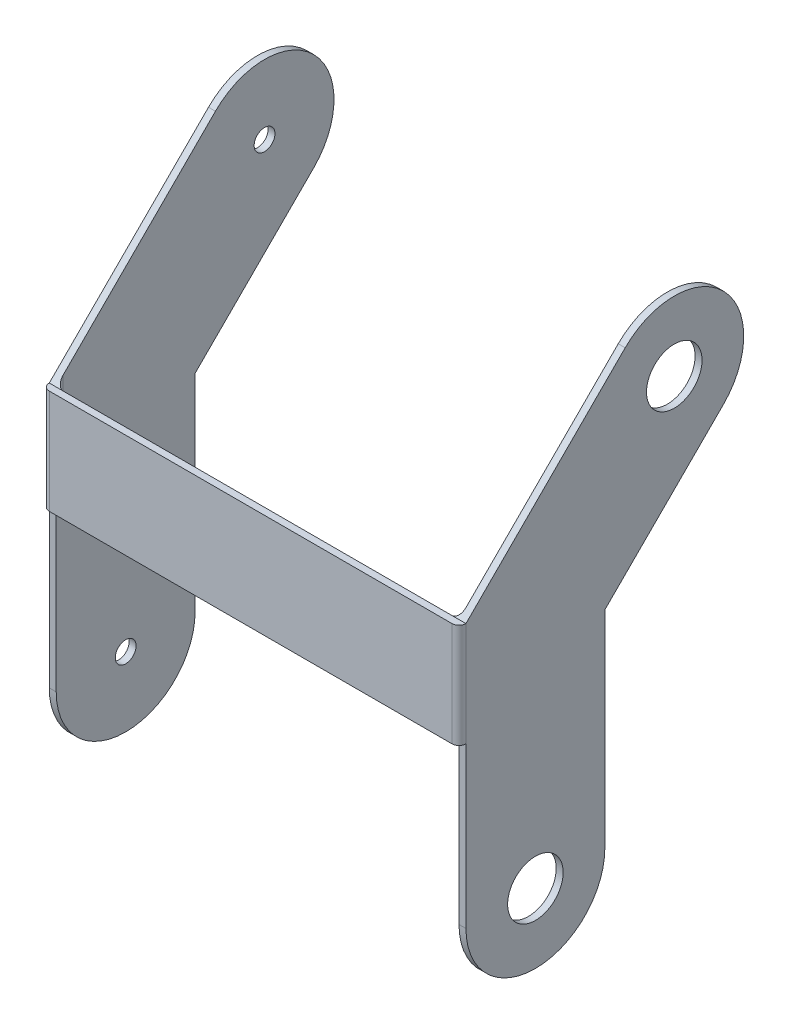
ISO-10303-21;
HEADER;
FILE_DESCRIPTION(('STEP AP214'),'2;1');
FILE_NAME('part.step','',(''),(''),'','','');
FILE_SCHEMA(('AUTOMOTIVE_DESIGN { 1 0 10303 214 1 1 1 1 }'));
ENDSEC;
DATA;
#1=APPLICATION_CONTEXT('core data for automotive mechanical design processes');
#2=APPLICATION_PROTOCOL_DEFINITION('international standard','automotive_design',2000,#1);
#3=PRODUCT_CONTEXT('',#1,'mechanical');
#4=PRODUCT('Part','Part','',(#3));
#5=PRODUCT_RELATED_PRODUCT_CATEGORY('part','',(#4));
#6=PRODUCT_DEFINITION_FORMATION('','',#4);
#7=PRODUCT_DEFINITION_CONTEXT('part definition',#1,'design');
#8=PRODUCT_DEFINITION('design','',#6,#7);
#9=PRODUCT_DEFINITION_SHAPE('','',#8);
#10=(LENGTH_UNIT() NAMED_UNIT(*) SI_UNIT(.MILLI.,.METRE.));
#11=(NAMED_UNIT(*) PLANE_ANGLE_UNIT() SI_UNIT($,.RADIAN.));
#12=(NAMED_UNIT(*) SI_UNIT($,.STERADIAN.) SOLID_ANGLE_UNIT());
#13=UNCERTAINTY_MEASURE_WITH_UNIT(LENGTH_MEASURE(1.E-05),#10,'distance_accuracy_value','');
#14=(GEOMETRIC_REPRESENTATION_CONTEXT(3) GLOBAL_UNCERTAINTY_ASSIGNED_CONTEXT((#13)) GLOBAL_UNIT_ASSIGNED_CONTEXT((#10,
#11,#12)) REPRESENTATION_CONTEXT('',''));
#15=CARTESIAN_POINT('',(0.,0.,0.));
#16=DIRECTION('',(0.,0.,1.));
#17=DIRECTION('',(1.,0.,0.));
#18=AXIS2_PLACEMENT_3D('',#15,#16,#17);
#19=CARTESIAN_POINT('',(1.,-38.019,0.));
#20=DIRECTION('',(0.,0.,-1.));
#21=DIRECTION('',(-1.,0.,0.));
#22=AXIS2_PLACEMENT_3D('',#19,#20,#21);
#23=PLANE('',#22);
#24=DIRECTION('',(-1.,0.,0.));
#25=VECTOR('',#24,1.);
#26=CARTESIAN_POINT('',(30.,-15.,0.));
#27=LINE('',#26,#25);
#28=CARTESIAN_POINT('',(1.,-15.,0.));
#29=VERTEX_POINT('',#28);
#30=CARTESIAN_POINT('',(0.,-15.,0.));
#31=VERTEX_POINT('',#30);
#32=EDGE_CURVE('E164',#29,#31,#27,.T.);
#33=ORIENTED_EDGE('',*,*,#32,.T.);
#34=DIRECTION('',(0.,-1.,0.));
#35=VECTOR('',#34,1.);
#36=CARTESIAN_POINT('',(0.,-38.019,0.));
#37=LINE('',#36,#35);
#38=CARTESIAN_POINT('',(0.,-38.019,0.));
#39=VERTEX_POINT('',#38);
#40=EDGE_CURVE('E175',#31,#39,#37,.T.);
#41=ORIENTED_EDGE('',*,*,#40,.T.);
#42=DIRECTION('',(-1.,0.,0.));
#43=VECTOR('',#42,1.);
#44=CARTESIAN_POINT('',(1.,-38.019,0.));
#45=LINE('',#44,#43);
#46=CARTESIAN_POINT('',(1.,-38.019,0.));
#47=VERTEX_POINT('',#46);
#48=EDGE_CURVE('E236',#47,#39,#45,.T.);
#49=ORIENTED_EDGE('',*,*,#48,.F.);
#50=DIRECTION('',(0.,-1.,0.));
#51=VECTOR('',#50,1.);
#52=CARTESIAN_POINT('',(1.,-38.019,0.));
#53=LINE('',#52,#51);
#54=EDGE_CURVE('E178',#29,#47,#53,.T.);
#55=ORIENTED_EDGE('',*,*,#54,.F.);
#56=EDGE_LOOP('',(#33,#41,#49,#55));
#57=FACE_BOUND('',#56,.T.);
#58=ADVANCED_FACE('F32',(#57),#23,.F.);
#59=CARTESIAN_POINT('',(1.,15.8575766748895,-29.9997122986205));
#60=DIRECTION('',(-1.,0.,0.));
#61=DIRECTION('',(0.,0.,1.));
#62=AXIS2_PLACEMENT_3D('',#59,#60,#61);
#63=PLANE('',#62);
#64=CARTESIAN_POINT('',(1.,15.8575766748895,-29.9997122986205));
#65=DIRECTION('',(1.,0.,0.));
#66=DIRECTION('',(0.,0.,-1.));
#67=AXIS2_PLACEMENT_3D('',#64,#65,#66);
#68=CIRCLE('',#67,1.5);
#69=CARTESIAN_POINT('',(1.,15.8575766748895,-31.4997122986205));
#70=VERTEX_POINT('',#69);
#71=EDGE_CURVE('E190',#70,#70,#68,.T.);
#72=ORIENTED_EDGE('',*,*,#71,.F.);
#73=EDGE_LOOP('',(#72));
#74=FACE_BOUND('',#73,.T.);
#75=DIRECTION('',(0.,-0.707106781186546,0.707106781186549));
#76=VECTOR('',#75,1.);
#77=CARTESIAN_POINT('',(1.,0.,0.));
#78=LINE('',#77,#76);
#79=CARTESIAN_POINT('',(1.,22.928644486755,-22.928644486755));
#80=VERTEX_POINT('',#79);
#81=CARTESIAN_POINT('',(1.,0.999999999999997,-0.999999999999999));
#82=VERTEX_POINT('',#81);
#83=EDGE_CURVE('E242',#80,#82,#78,.T.);
#84=ORIENTED_EDGE('',*,*,#83,.T.);
#85=DIRECTION('',(0.,-1.,0.));
#86=VECTOR('',#85,1.);
#87=CARTESIAN_POINT('',(1.,-15.,-1.));
#88=LINE('',#87,#86);
#89=CARTESIAN_POINT('',(1.,-15.,-1.));
#90=VERTEX_POINT('',#89);
#91=EDGE_CURVE('E233',#82,#90,#88,.T.);
#92=ORIENTED_EDGE('',*,*,#91,.T.);
#93=DIRECTION('',(0.,0.,1.));
#94=VECTOR('',#93,1.);
#95=CARTESIAN_POINT('',(1.,-15.,0.));
#96=LINE('',#95,#94);
#97=EDGE_CURVE('E234',#90,#29,#96,.T.);
#98=ORIENTED_EDGE('',*,*,#97,.T.);
#99=ORIENTED_EDGE('',*,*,#54,.T.);
#100=CARTESIAN_POINT('',(1.,-38.019,-10.));
#101=DIRECTION('',(1.,0.,0.));
#102=DIRECTION('',(0.,0.,1.));
#103=AXIS2_PLACEMENT_3D('',#100,#101,#102);
#104=CIRCLE('',#103,10.);
#105=CARTESIAN_POINT('',(1.,-38.019,-20.));
#106=VERTEX_POINT('',#105);
#107=EDGE_CURVE('E275',#47,#106,#104,.T.);
#108=ORIENTED_EDGE('',*,*,#107,.T.);
#109=DIRECTION('',(0.,1.,0.));
#110=VECTOR('',#109,1.);
#111=CARTESIAN_POINT('',(1.,-8.28427124746194,-20.));
#112=LINE('',#111,#110);
#113=CARTESIAN_POINT('',(1.,-8.28427124746194,-20.));
#114=VERTEX_POINT('',#113);
#115=EDGE_CURVE('E273',#106,#114,#112,.T.);
#116=ORIENTED_EDGE('',*,*,#115,.T.);
#117=DIRECTION('',(0.,0.707106781186546,-0.707106781186549));
#118=VECTOR('',#117,1.);
#119=CARTESIAN_POINT('',(1.,8.78650886302398,-37.070780110486));
#120=LINE('',#119,#118);
#121=CARTESIAN_POINT('',(1.,8.78650886302399,-37.070780110486));
#122=VERTEX_POINT('',#121);
#123=EDGE_CURVE('E271',#114,#122,#120,.T.);
#124=ORIENTED_EDGE('',*,*,#123,.T.);
#125=CARTESIAN_POINT('',(1.,15.8575766748895,-29.9997122986205));
#126=DIRECTION('',(1.,0.,0.));
#127=DIRECTION('',(0.,0.,1.));
#128=AXIS2_PLACEMENT_3D('',#125,#126,#127);
#129=CIRCLE('',#128,10.);
#130=EDGE_CURVE('E269',#122,#80,#129,.T.);
#131=ORIENTED_EDGE('',*,*,#130,.T.);
#132=EDGE_LOOP('',(#84,#92,#98,#99,#108,#116,#124,#131));
#133=FACE_BOUND('',#132,.T.);
#134=CARTESIAN_POINT('',(1.,-38.019,-10.));
#135=DIRECTION('',(1.,0.,0.));
#136=DIRECTION('',(0.,0.,-1.));
#137=AXIS2_PLACEMENT_3D('',#134,#135,#136);
#138=CIRCLE('',#137,1.5);
#139=CARTESIAN_POINT('',(1.,-38.019,-11.5));
#140=VERTEX_POINT('',#139);
#141=EDGE_CURVE('E281',#140,#140,#138,.T.);
#142=ORIENTED_EDGE('',*,*,#141,.F.);
#143=EDGE_LOOP('',(#142));
#144=FACE_BOUND('',#143,.T.);
#145=ADVANCED_FACE('F239',(#74,#133,#144),#63,.F.);
#146=CARTESIAN_POINT('',(0.,15.8575766748895,-29.9997122986205));
#147=DIRECTION('',(-1.,0.,0.));
#148=DIRECTION('',(0.,0.,1.));
#149=AXIS2_PLACEMENT_3D('',#146,#147,#148);
#150=PLANE('',#149);
#151=CARTESIAN_POINT('',(0.,15.8575766748895,-29.9997122986205));
#152=DIRECTION('',(1.,0.,0.));
#153=DIRECTION('',(0.,0.,-1.));
#154=AXIS2_PLACEMENT_3D('',#151,#152,#153);
#155=CIRCLE('',#154,1.5);
#156=CARTESIAN_POINT('',(0.,15.8575766748895,-31.4997122986205));
#157=VERTEX_POINT('',#156);
#158=EDGE_CURVE('E278',#157,#157,#155,.T.);
#159=ORIENTED_EDGE('',*,*,#158,.T.);
#160=EDGE_LOOP('',(#159));
#161=FACE_BOUND('',#160,.T.);
#162=ORIENTED_EDGE('',*,*,#40,.F.);
#163=DIRECTION('',(0.,-1.,0.));
#164=VECTOR('',#163,1.);
#165=CARTESIAN_POINT('',(0.,0.,0.));
#166=LINE('',#165,#164);
#167=CARTESIAN_POINT('',(0.,0.,0.));
#168=VERTEX_POINT('',#167);
#169=EDGE_CURVE('E122',#31,#168,#166,.F.);
#170=ORIENTED_EDGE('',*,*,#169,.T.);
#171=DIRECTION('',(0.,-0.707106781186546,0.707106781186549));
#172=VECTOR('',#171,1.);
#173=CARTESIAN_POINT('',(0.,0.,0.));
#174=LINE('',#173,#172);
#175=CARTESIAN_POINT('',(0.,22.928644486755,-22.928644486755));
#176=VERTEX_POINT('',#175);
#177=EDGE_CURVE('E259',#176,#168,#174,.T.);
#178=ORIENTED_EDGE('',*,*,#177,.F.);
#179=CARTESIAN_POINT('',(0.,15.8575766748895,-29.9997122986205));
#180=DIRECTION('',(1.,0.,0.));
#181=DIRECTION('',(0.,0.,1.));
#182=AXIS2_PLACEMENT_3D('',#179,#180,#181);
#183=CIRCLE('',#182,10.);
#184=CARTESIAN_POINT('',(0.,8.78650886302399,-37.070780110486));
#185=VERTEX_POINT('',#184);
#186=EDGE_CURVE('E261',#185,#176,#183,.T.);
#187=ORIENTED_EDGE('',*,*,#186,.F.);
#188=DIRECTION('',(0.,0.707106781186546,-0.707106781186549));
#189=VECTOR('',#188,1.);
#190=CARTESIAN_POINT('',(0.,8.78650886302398,-37.070780110486));
#191=LINE('',#190,#189);
#192=CARTESIAN_POINT('',(0.,-8.28427124746194,-20.));
#193=VERTEX_POINT('',#192);
#194=EDGE_CURVE('E263',#193,#185,#191,.T.);
#195=ORIENTED_EDGE('',*,*,#194,.F.);
#196=DIRECTION('',(0.,1.,0.));
#197=VECTOR('',#196,1.);
#198=CARTESIAN_POINT('',(0.,-8.28427124746194,-20.));
#199=LINE('',#198,#197);
#200=CARTESIAN_POINT('',(0.,-38.019,-20.));
#201=VERTEX_POINT('',#200);
#202=EDGE_CURVE('E265',#201,#193,#199,.T.);
#203=ORIENTED_EDGE('',*,*,#202,.F.);
#204=CARTESIAN_POINT('',(0.,-38.019,-10.));
#205=DIRECTION('',(1.,0.,0.));
#206=DIRECTION('',(0.,0.,1.));
#207=AXIS2_PLACEMENT_3D('',#204,#205,#206);
#208=CIRCLE('',#207,10.);
#209=EDGE_CURVE('E188',#39,#201,#208,.T.);
#210=ORIENTED_EDGE('',*,*,#209,.F.);
#211=EDGE_LOOP('',(#162,#170,#178,#187,#195,#203,#210));
#212=FACE_BOUND('',#211,.T.);
#213=CARTESIAN_POINT('',(0.,-38.019,-10.));
#214=DIRECTION('',(1.,0.,0.));
#215=DIRECTION('',(0.,0.,-1.));
#216=AXIS2_PLACEMENT_3D('',#213,#214,#215);
#217=CIRCLE('',#216,1.5);
#218=CARTESIAN_POINT('',(0.,-38.019,-11.5));
#219=VERTEX_POINT('',#218);
#220=EDGE_CURVE('E284',#219,#219,#217,.T.);
#221=ORIENTED_EDGE('',*,*,#220,.T.);
#222=EDGE_LOOP('',(#221));
#223=FACE_BOUND('',#222,.T.);
#224=ADVANCED_FACE('F182',(#161,#212,#223),#150,.T.);
#225=CARTESIAN_POINT('',(1.,-38.019,-10.));
#226=DIRECTION('',(-1.,0.,0.));
#227=DIRECTION('',(0.,0.,1.));
#228=AXIS2_PLACEMENT_3D('',#225,#226,#227);
#229=CYLINDRICAL_SURFACE('',#228,10.);
#230=ORIENTED_EDGE('',*,*,#209,.T.);
#231=DIRECTION('',(-1.,0.,0.));
#232=VECTOR('',#231,1.);
#233=CARTESIAN_POINT('',(1.,-38.019,-20.));
#234=LINE('',#233,#232);
#235=EDGE_CURVE('E246',#106,#201,#234,.T.);
#236=ORIENTED_EDGE('',*,*,#235,.F.);
#237=ORIENTED_EDGE('',*,*,#107,.F.);
#238=ORIENTED_EDGE('',*,*,#48,.T.);
#239=EDGE_LOOP('',(#230,#236,#237,#238));
#240=FACE_BOUND('',#239,.T.);
#241=ADVANCED_FACE('F426',(#240),#229,.T.);
#242=CARTESIAN_POINT('',(1.,-8.28427124746194,-20.));
#243=DIRECTION('',(0.,0.,1.));
#244=DIRECTION('',(1.,0.,0.));
#245=AXIS2_PLACEMENT_3D('',#242,#243,#244);
#246=PLANE('',#245);
#247=ORIENTED_EDGE('',*,*,#202,.T.);
#248=DIRECTION('',(-1.,0.,0.));
#249=VECTOR('',#248,1.);
#250=CARTESIAN_POINT('',(1.,-8.28427124746194,-20.));
#251=LINE('',#250,#249);
#252=EDGE_CURVE('E249',#114,#193,#251,.T.);
#253=ORIENTED_EDGE('',*,*,#252,.F.);
#254=ORIENTED_EDGE('',*,*,#115,.F.);
#255=ORIENTED_EDGE('',*,*,#235,.T.);
#256=EDGE_LOOP('',(#247,#253,#254,#255));
#257=FACE_BOUND('',#256,.T.);
#258=ADVANCED_FACE('F623',(#257),#246,.F.);
#259=CARTESIAN_POINT('',(1.,8.78650886302398,-37.070780110486));
#260=DIRECTION('',(0.,0.707106781186549,0.707106781186546));
#261=DIRECTION('',(0.,-0.707106781186546,0.707106781186549));
#262=AXIS2_PLACEMENT_3D('',#259,#260,#261);
#263=PLANE('',#262);
#264=ORIENTED_EDGE('',*,*,#194,.T.);
#265=DIRECTION('',(-1.,0.,0.));
#266=VECTOR('',#265,1.);
#267=CARTESIAN_POINT('',(1.,8.78650886302399,-37.070780110486));
#268=LINE('',#267,#266);
#269=EDGE_CURVE('E252',#122,#185,#268,.T.);
#270=ORIENTED_EDGE('',*,*,#269,.F.);
#271=ORIENTED_EDGE('',*,*,#123,.F.);
#272=ORIENTED_EDGE('',*,*,#252,.T.);
#273=EDGE_LOOP('',(#264,#270,#271,#272));
#274=FACE_BOUND('',#273,.T.);
#275=ADVANCED_FACE('F614',(#274),#263,.F.);
#276=CARTESIAN_POINT('',(1.,15.8575766748895,-29.9997122986205));
#277=DIRECTION('',(-1.,0.,0.));
#278=DIRECTION('',(0.,0.,1.));
#279=AXIS2_PLACEMENT_3D('',#276,#277,#278);
#280=CYLINDRICAL_SURFACE('',#279,10.);
#281=ORIENTED_EDGE('',*,*,#186,.T.);
#282=DIRECTION('',(-1.,0.,0.));
#283=VECTOR('',#282,1.);
#284=CARTESIAN_POINT('',(1.,22.928644486755,-22.928644486755));
#285=LINE('',#284,#283);
#286=EDGE_CURVE('E255',#80,#176,#285,.T.);
#287=ORIENTED_EDGE('',*,*,#286,.F.);
#288=ORIENTED_EDGE('',*,*,#130,.F.);
#289=ORIENTED_EDGE('',*,*,#269,.T.);
#290=EDGE_LOOP('',(#281,#287,#288,#289));
#291=FACE_BOUND('',#290,.T.);
#292=ADVANCED_FACE('F607',(#291),#280,.T.);
#293=CARTESIAN_POINT('',(1.,0.,0.));
#294=DIRECTION('',(0.,-0.707106781186549,-0.707106781186546));
#295=DIRECTION('',(0.,0.707106781186546,-0.707106781186549));
#296=AXIS2_PLACEMENT_3D('',#293,#294,#295);
#297=PLANE('',#296);
#298=ORIENTED_EDGE('',*,*,#177,.T.);
#299=DIRECTION('',(-1.,0.,0.));
#300=VECTOR('',#299,1.);
#301=CARTESIAN_POINT('',(1.,0.,0.));
#302=LINE('',#301,#300);
#303=CARTESIAN_POINT('',(2.,0.,0.));
#304=VERTEX_POINT('',#303);
#305=EDGE_CURVE('E70',#304,#168,#302,.T.);
#306=ORIENTED_EDGE('',*,*,#305,.F.);
#307=CARTESIAN_POINT('',(2.,0.999999999999997,-0.999999999999999));
#308=DIRECTION('',(0.,-0.707106781186549,-0.707106781186546));
#309=DIRECTION('',(0.,0.707106781186546,-0.707106781186549));
#310=AXIS2_PLACEMENT_3D('',#307,#308,#309);
#311=ELLIPSE('',#310,1.41421356237309,1.);
#312=EDGE_CURVE('E132',#304,#82,#311,.T.);
#313=ORIENTED_EDGE('',*,*,#312,.T.);
#314=ORIENTED_EDGE('',*,*,#83,.F.);
#315=ORIENTED_EDGE('',*,*,#286,.T.);
#316=EDGE_LOOP('',(#298,#306,#313,#314,#315));
#317=FACE_BOUND('',#316,.T.);
#318=ADVANCED_FACE('F598',(#317),#297,.F.);
#319=CARTESIAN_POINT('',(1.,15.8575766748895,-29.9997122986205));
#320=DIRECTION('',(-1.,0.,0.));
#321=DIRECTION('',(0.,0.,1.));
#322=AXIS2_PLACEMENT_3D('',#319,#320,#321);
#323=CYLINDRICAL_SURFACE('',#322,1.5);
#324=ORIENTED_EDGE('',*,*,#71,.T.);
#325=EDGE_LOOP('',(#324));
#326=FACE_BOUND('',#325,.T.);
#327=ORIENTED_EDGE('',*,*,#158,.F.);
#328=EDGE_LOOP('',(#327));
#329=FACE_BOUND('',#328,.T.);
#330=ADVANCED_FACE('F589',(#326,#329),#323,.F.);
#331=CARTESIAN_POINT('',(1.,-38.019,-10.));
#332=DIRECTION('',(-1.,0.,0.));
#333=DIRECTION('',(0.,0.,1.));
#334=AXIS2_PLACEMENT_3D('',#331,#332,#333);
#335=CYLINDRICAL_SURFACE('',#334,1.5);
#336=ORIENTED_EDGE('',*,*,#141,.T.);
#337=EDGE_LOOP('',(#336));
#338=FACE_BOUND('',#337,.T.);
#339=ORIENTED_EDGE('',*,*,#220,.F.);
#340=EDGE_LOOP('',(#339));
#341=FACE_BOUND('',#340,.T.);
#342=ADVANCED_FACE('F562',(#338,#341),#335,.F.);
#343=CARTESIAN_POINT('',(30.,0.,0.));
#344=DIRECTION('',(0.,0.,1.));
#345=DIRECTION('',(0.,-1.,0.));
#346=AXIS2_PLACEMENT_3D('',#343,#344,#345);
#347=PLANE('',#346);
#348=CARTESIAN_POINT('',(58.,-15.,0.));
#349=VERTEX_POINT('',#348);
#350=CARTESIAN_POINT('',(2.,-15.,0.));
#351=VERTEX_POINT('',#350);
#352=EDGE_CURVE('E134',#349,#351,#27,.T.);
#353=ORIENTED_EDGE('',*,*,#352,.T.);
#354=DIRECTION('',(0.,-1.,0.));
#355=VECTOR('',#354,1.);
#356=CARTESIAN_POINT('',(2.,0.,0.));
#357=LINE('',#356,#355);
#358=EDGE_CURVE('E151',#351,#304,#357,.F.);
#359=ORIENTED_EDGE('',*,*,#358,.T.);
#360=DIRECTION('',(-1.,0.,0.));
#361=VECTOR('',#360,1.);
#362=CARTESIAN_POINT('',(30.,0.,0.));
#363=LINE('',#362,#361);
#364=CARTESIAN_POINT('',(58.,0.,0.));
#365=VERTEX_POINT('',#364);
#366=EDGE_CURVE('E117',#365,#304,#363,.T.);
#367=ORIENTED_EDGE('',*,*,#366,.F.);
#368=DIRECTION('',(0.,-1.,0.));
#369=VECTOR('',#368,1.);
#370=CARTESIAN_POINT('',(58.,-15.,0.));
#371=LINE('',#370,#369);
#372=EDGE_CURVE('E153',#365,#349,#371,.T.);
#373=ORIENTED_EDGE('',*,*,#372,.T.);
#374=EDGE_LOOP('',(#353,#359,#367,#373));
#375=FACE_BOUND('',#374,.T.);
#376=ADVANCED_FACE('F554',(#375),#347,.F.);
#377=CARTESIAN_POINT('',(30.,0.,0.));
#378=DIRECTION('',(0.,-1.,0.));
#379=DIRECTION('',(0.,0.,-1.));
#380=AXIS2_PLACEMENT_3D('',#377,#378,#379);
#381=PLANE('',#380);
#382=ORIENTED_EDGE('',*,*,#305,.T.);
#383=CARTESIAN_POINT('',(1.,0.,0.));
#384=DIRECTION('',(0.,-1.,0.));
#385=DIRECTION('',(0.,0.,-1.));
#386=AXIS2_PLACEMENT_3D('',#383,#384,#385);
#387=CIRCLE('',#386,1.);
#388=CARTESIAN_POINT('',(1.,0.,1.));
#389=VERTEX_POINT('',#388);
#390=EDGE_CURVE('E116',#168,#389,#387,.F.);
#391=ORIENTED_EDGE('',*,*,#390,.T.);
#392=DIRECTION('',(-1.,0.,0.));
#393=VECTOR('',#392,1.);
#394=CARTESIAN_POINT('',(30.,0.,1.));
#395=LINE('',#394,#393);
#396=CARTESIAN_POINT('',(59.,0.,1.));
#397=VERTEX_POINT('',#396);
#398=EDGE_CURVE('E103',#397,#389,#395,.T.);
#399=ORIENTED_EDGE('',*,*,#398,.F.);
#400=CARTESIAN_POINT('',(59.,0.,0.));
#401=DIRECTION('',(0.,-1.,0.));
#402=DIRECTION('',(0.,0.,-1.));
#403=AXIS2_PLACEMENT_3D('',#400,#401,#402);
#404=CIRCLE('',#403,1.);
#405=CARTESIAN_POINT('',(60.,0.,0.));
#406=VERTEX_POINT('',#405);
#407=EDGE_CURVE('E114',#397,#406,#404,.F.);
#408=ORIENTED_EDGE('',*,*,#407,.T.);
#409=DIRECTION('',(1.,0.,0.));
#410=VECTOR('',#409,1.);
#411=CARTESIAN_POINT('',(59.,0.,0.));
#412=LINE('',#411,#410);
#413=EDGE_CURVE('E47',#365,#406,#412,.T.);
#414=ORIENTED_EDGE('',*,*,#413,.F.);
#415=ORIENTED_EDGE('',*,*,#366,.T.);
#416=EDGE_LOOP('',(#382,#391,#399,#408,#414,#415));
#417=FACE_BOUND('',#416,.T.);
#418=ADVANCED_FACE('F112',(#417),#381,.F.);
#419=CARTESIAN_POINT('',(30.,0.,1.));
#420=DIRECTION('',(0.,0.,-1.));
#421=DIRECTION('',(0.,1.,0.));
#422=AXIS2_PLACEMENT_3D('',#419,#420,#421);
#423=PLANE('',#422);
#424=ORIENTED_EDGE('',*,*,#398,.T.);
#425=DIRECTION('',(0.,-1.,0.));
#426=VECTOR('',#425,1.);
#427=CARTESIAN_POINT('',(1.,-15.,0.999999999999998));
#428=LINE('',#427,#426);
#429=CARTESIAN_POINT('',(1.,-15.,0.999999999999998));
#430=VERTEX_POINT('',#429);
#431=EDGE_CURVE('E110',#389,#430,#428,.T.);
#432=ORIENTED_EDGE('',*,*,#431,.T.);
#433=DIRECTION('',(-1.,0.,0.));
#434=VECTOR('',#433,1.);
#435=CARTESIAN_POINT('',(30.,-15.,0.999999999999998));
#436=LINE('',#435,#434);
#437=CARTESIAN_POINT('',(59.,-15.,0.999999999999998));
#438=VERTEX_POINT('',#437);
#439=EDGE_CURVE('E106',#438,#430,#436,.T.);
#440=ORIENTED_EDGE('',*,*,#439,.F.);
#441=DIRECTION('',(0.,-1.,0.));
#442=VECTOR('',#441,1.);
#443=CARTESIAN_POINT('',(59.,0.,1.));
#444=LINE('',#443,#442);
#445=EDGE_CURVE('E99',#438,#397,#444,.F.);
#446=ORIENTED_EDGE('',*,*,#445,.T.);
#447=EDGE_LOOP('',(#424,#432,#440,#446));
#448=FACE_BOUND('',#447,.T.);
#449=ADVANCED_FACE('F101',(#448),#423,.F.);
#450=CARTESIAN_POINT('',(30.,-15.,0.));
#451=DIRECTION('',(0.,1.,0.));
#452=DIRECTION('',(0.,0.,1.));
#453=AXIS2_PLACEMENT_3D('',#450,#451,#452);
#454=PLANE('',#453);
#455=ORIENTED_EDGE('',*,*,#439,.T.);
#456=CARTESIAN_POINT('',(1.,-15.,0.));
#457=DIRECTION('',(0.,1.,0.));
#458=DIRECTION('',(0.,0.,1.));
#459=AXIS2_PLACEMENT_3D('',#456,#457,#458);
#460=CIRCLE('',#459,1.);
#461=EDGE_CURVE('E126',#430,#31,#460,.F.);
#462=ORIENTED_EDGE('',*,*,#461,.T.);
#463=ORIENTED_EDGE('',*,*,#32,.F.);
#464=ORIENTED_EDGE('',*,*,#97,.F.);
#465=CARTESIAN_POINT('',(2.,-15.,-1.));
#466=DIRECTION('',(0.,1.,0.));
#467=DIRECTION('',(0.,0.,1.));
#468=AXIS2_PLACEMENT_3D('',#465,#466,#467);
#469=CIRCLE('',#468,1.);
#470=EDGE_CURVE('E81',#90,#351,#469,.T.);
#471=ORIENTED_EDGE('',*,*,#470,.T.);
#472=ORIENTED_EDGE('',*,*,#352,.F.);
#473=CARTESIAN_POINT('',(58.,-15.,-1.));
#474=DIRECTION('',(0.,1.,0.));
#475=DIRECTION('',(0.,0.,1.));
#476=AXIS2_PLACEMENT_3D('',#473,#474,#475);
#477=CIRCLE('',#476,1.);
#478=CARTESIAN_POINT('',(59.,-15.,-1.));
#479=VERTEX_POINT('',#478);
#480=EDGE_CURVE('E40',#349,#479,#477,.T.);
#481=ORIENTED_EDGE('',*,*,#480,.T.);
#482=DIRECTION('',(0.,0.,-1.));
#483=VECTOR('',#482,1.);
#484=CARTESIAN_POINT('',(59.,-15.,0.));
#485=LINE('',#484,#483);
#486=CARTESIAN_POINT('',(59.,-15.,0.));
#487=VERTEX_POINT('',#486);
#488=EDGE_CURVE('E56',#487,#479,#485,.T.);
#489=ORIENTED_EDGE('',*,*,#488,.F.);
#490=DIRECTION('',(1.,0.,0.));
#491=VECTOR('',#490,1.);
#492=CARTESIAN_POINT('',(30.,-15.,0.));
#493=LINE('',#492,#491);
#494=CARTESIAN_POINT('',(60.,-15.,0.));
#495=VERTEX_POINT('',#494);
#496=EDGE_CURVE('E325',#487,#495,#493,.T.);
#497=ORIENTED_EDGE('',*,*,#496,.T.);
#498=CARTESIAN_POINT('',(59.,-15.,0.));
#499=DIRECTION('',(0.,1.,0.));
#500=DIRECTION('',(0.,0.,1.));
#501=AXIS2_PLACEMENT_3D('',#498,#499,#500);
#502=CIRCLE('',#501,1.);
#503=EDGE_CURVE('E158',#495,#438,#502,.F.);
#504=ORIENTED_EDGE('',*,*,#503,.T.);
#505=EDGE_LOOP('',(#455,#462,#463,#464,#471,#472,#481,#489,#497,#504));
#506=FACE_BOUND('',#505,.T.);
#507=ADVANCED_FACE('F133',(#506),#454,.F.);
#508=CARTESIAN_POINT('',(59.,-38.019,0.));
#509=DIRECTION('',(0.,0.,-1.));
#510=DIRECTION('',(1.,0.,0.));
#511=AXIS2_PLACEMENT_3D('',#508,#509,#510);
#512=PLANE('',#511);
#513=ORIENTED_EDGE('',*,*,#496,.F.);
#514=DIRECTION('',(0.,-1.,0.));
#515=VECTOR('',#514,1.);
#516=CARTESIAN_POINT('',(59.,-38.019,0.));
#517=LINE('',#516,#515);
#518=CARTESIAN_POINT('',(59.,-38.019,0.));
#519=VERTEX_POINT('',#518);
#520=EDGE_CURVE('E146',#487,#519,#517,.T.);
#521=ORIENTED_EDGE('',*,*,#520,.T.);
#522=DIRECTION('',(1.,0.,0.));
#523=VECTOR('',#522,1.);
#524=CARTESIAN_POINT('',(59.,-38.019,0.));
#525=LINE('',#524,#523);
#526=CARTESIAN_POINT('',(60.,-38.019,0.));
#527=VERTEX_POINT('',#526);
#528=EDGE_CURVE('E179',#519,#527,#525,.T.);
#529=ORIENTED_EDGE('',*,*,#528,.T.);
#530=DIRECTION('',(0.,-1.,0.));
#531=VECTOR('',#530,1.);
#532=CARTESIAN_POINT('',(60.,-38.019,0.));
#533=LINE('',#532,#531);
#534=EDGE_CURVE('E322',#495,#527,#533,.T.);
#535=ORIENTED_EDGE('',*,*,#534,.F.);
#536=EDGE_LOOP('',(#513,#521,#529,#535));
#537=FACE_BOUND('',#536,.T.);
#538=ADVANCED_FACE('F406',(#537),#512,.F.);
#539=CARTESIAN_POINT('',(59.,15.8575766748895,-29.9997122986205));
#540=DIRECTION('',(1.,0.,0.));
#541=DIRECTION('',(0.,0.,1.));
#542=AXIS2_PLACEMENT_3D('',#539,#540,#541);
#543=PLANE('',#542);
#544=CARTESIAN_POINT('',(59.,-38.019,-10.));
#545=DIRECTION('',(1.,0.,0.));
#546=DIRECTION('',(0.,0.,-1.));
#547=AXIS2_PLACEMENT_3D('',#544,#545,#546);
#548=CIRCLE('',#547,4.);
#549=CARTESIAN_POINT('',(59.,-38.019,-14.));
#550=VERTEX_POINT('',#549);
#551=EDGE_CURVE('E347',#550,#550,#548,.F.);
#552=ORIENTED_EDGE('',*,*,#551,.F.);
#553=EDGE_LOOP('',(#552));
#554=FACE_BOUND('',#553,.T.);
#555=CARTESIAN_POINT('',(59.,15.8575766748895,-29.9997122986205));
#556=DIRECTION('',(1.,0.,0.));
#557=DIRECTION('',(0.,0.,-1.));
#558=AXIS2_PLACEMENT_3D('',#555,#556,#557);
#559=CIRCLE('',#558,4.00000000000001);
#560=CARTESIAN_POINT('',(59.,15.8575766748895,-33.9997122986205));
#561=VERTEX_POINT('',#560);
#562=EDGE_CURVE('E341',#561,#561,#559,.F.);
#563=ORIENTED_EDGE('',*,*,#562,.F.);
#564=EDGE_LOOP('',(#563));
#565=FACE_BOUND('',#564,.T.);
#566=ORIENTED_EDGE('',*,*,#520,.F.);
#567=ORIENTED_EDGE('',*,*,#488,.T.);
#568=DIRECTION('',(0.,-1.,0.));
#569=VECTOR('',#568,1.);
#570=CARTESIAN_POINT('',(59.,0.,-1.));
#571=LINE('',#570,#569);
#572=CARTESIAN_POINT('',(59.,0.999999999999997,-1.));
#573=VERTEX_POINT('',#572);
#574=EDGE_CURVE('E142',#479,#573,#571,.F.);
#575=ORIENTED_EDGE('',*,*,#574,.T.);
#576=DIRECTION('',(0.,-0.707106781186546,0.707106781186549));
#577=VECTOR('',#576,1.);
#578=CARTESIAN_POINT('',(59.,0.,0.));
#579=LINE('',#578,#577);
#580=CARTESIAN_POINT('',(59.,22.928644486755,-22.928644486755));
#581=VERTEX_POINT('',#580);
#582=EDGE_CURVE('E306',#581,#573,#579,.T.);
#583=ORIENTED_EDGE('',*,*,#582,.F.);
#584=CARTESIAN_POINT('',(59.,15.8575766748895,-29.9997122986205));
#585=DIRECTION('',(1.,0.,0.));
#586=DIRECTION('',(0.,0.,1.));
#587=AXIS2_PLACEMENT_3D('',#584,#585,#586);
#588=CIRCLE('',#587,10.);
#589=CARTESIAN_POINT('',(59.,8.78650886302399,-37.070780110486));
#590=VERTEX_POINT('',#589);
#591=EDGE_CURVE('E327',#590,#581,#588,.T.);
#592=ORIENTED_EDGE('',*,*,#591,.F.);
#593=DIRECTION('',(0.,0.707106781186546,-0.707106781186549));
#594=VECTOR('',#593,1.);
#595=CARTESIAN_POINT('',(59.,8.78650886302398,-37.070780110486));
#596=LINE('',#595,#594);
#597=CARTESIAN_POINT('',(59.,-8.28427124746194,-20.));
#598=VERTEX_POINT('',#597);
#599=EDGE_CURVE('E330',#598,#590,#596,.T.);
#600=ORIENTED_EDGE('',*,*,#599,.F.);
#601=DIRECTION('',(0.,1.,0.));
#602=VECTOR('',#601,1.);
#603=CARTESIAN_POINT('',(59.,-8.28427124746194,-20.));
#604=LINE('',#603,#602);
#605=CARTESIAN_POINT('',(59.,-38.019,-20.));
#606=VERTEX_POINT('',#605);
#607=EDGE_CURVE('E333',#606,#598,#604,.T.);
#608=ORIENTED_EDGE('',*,*,#607,.F.);
#609=CARTESIAN_POINT('',(59.,-38.019,-10.));
#610=DIRECTION('',(1.,0.,0.));
#611=DIRECTION('',(0.,0.,1.));
#612=AXIS2_PLACEMENT_3D('',#609,#610,#611);
#613=CIRCLE('',#612,10.);
#614=EDGE_CURVE('E336',#519,#606,#613,.T.);
#615=ORIENTED_EDGE('',*,*,#614,.F.);
#616=EDGE_LOOP('',(#566,#567,#575,#583,#592,#600,#608,#615));
#617=FACE_BOUND('',#616,.T.);
#618=ADVANCED_FACE('F140',(#554,#565,#617),#543,.F.);
#619=CARTESIAN_POINT('',(60.,15.8575766748895,-29.9997122986205));
#620=DIRECTION('',(1.,0.,0.));
#621=DIRECTION('',(0.,0.,1.));
#622=AXIS2_PLACEMENT_3D('',#619,#620,#621);
#623=PLANE('',#622);
#624=CARTESIAN_POINT('',(60.,-38.019,-10.));
#625=DIRECTION('',(1.,0.,0.));
#626=DIRECTION('',(0.,0.,-1.));
#627=AXIS2_PLACEMENT_3D('',#624,#625,#626);
#628=CIRCLE('',#627,4.);
#629=CARTESIAN_POINT('',(60.,-38.019,-14.));
#630=VERTEX_POINT('',#629);
#631=EDGE_CURVE('E350',#630,#630,#628,.T.);
#632=ORIENTED_EDGE('',*,*,#631,.F.);
#633=EDGE_LOOP('',(#632));
#634=FACE_BOUND('',#633,.T.);
#635=CARTESIAN_POINT('',(60.,15.8575766748895,-29.9997122986205));
#636=DIRECTION('',(1.,0.,0.));
#637=DIRECTION('',(0.,0.,-1.));
#638=AXIS2_PLACEMENT_3D('',#635,#636,#637);
#639=CIRCLE('',#638,4.00000000000001);
#640=CARTESIAN_POINT('',(60.,15.8575766748895,-33.9997122986205));
#641=VERTEX_POINT('',#640);
#642=EDGE_CURVE('E344',#641,#641,#639,.T.);
#643=ORIENTED_EDGE('',*,*,#642,.F.);
#644=EDGE_LOOP('',(#643));
#645=FACE_BOUND('',#644,.T.);
#646=DIRECTION('',(0.,-0.707106781186546,0.707106781186549));
#647=VECTOR('',#646,1.);
#648=CARTESIAN_POINT('',(60.,0.,0.));
#649=LINE('',#648,#647);
#650=CARTESIAN_POINT('',(60.,22.928644486755,-22.928644486755));
#651=VERTEX_POINT('',#650);
#652=EDGE_CURVE('E307',#651,#406,#649,.T.);
#653=ORIENTED_EDGE('',*,*,#652,.T.);
#654=DIRECTION('',(0.,-1.,0.));
#655=VECTOR('',#654,1.);
#656=CARTESIAN_POINT('',(60.,-15.,0.));
#657=LINE('',#656,#655);
#658=EDGE_CURVE('E121',#406,#495,#657,.T.);
#659=ORIENTED_EDGE('',*,*,#658,.T.);
#660=ORIENTED_EDGE('',*,*,#534,.T.);
#661=CARTESIAN_POINT('',(60.,-38.019,-10.));
#662=DIRECTION('',(1.,0.,0.));
#663=DIRECTION('',(0.,0.,1.));
#664=AXIS2_PLACEMENT_3D('',#661,#662,#663);
#665=CIRCLE('',#664,10.);
#666=CARTESIAN_POINT('',(60.,-38.019,-20.));
#667=VERTEX_POINT('',#666);
#668=EDGE_CURVE('E319',#527,#667,#665,.T.);
#669=ORIENTED_EDGE('',*,*,#668,.T.);
#670=DIRECTION('',(0.,1.,0.));
#671=VECTOR('',#670,1.);
#672=CARTESIAN_POINT('',(60.,-8.28427124746194,-20.));
#673=LINE('',#672,#671);
#674=CARTESIAN_POINT('',(60.,-8.28427124746194,-20.));
#675=VERTEX_POINT('',#674);
#676=EDGE_CURVE('E316',#667,#675,#673,.T.);
#677=ORIENTED_EDGE('',*,*,#676,.T.);
#678=DIRECTION('',(0.,0.707106781186546,-0.707106781186549));
#679=VECTOR('',#678,1.);
#680=CARTESIAN_POINT('',(60.,8.78650886302398,-37.070780110486));
#681=LINE('',#680,#679);
#682=CARTESIAN_POINT('',(60.,8.78650886302399,-37.070780110486));
#683=VERTEX_POINT('',#682);
#684=EDGE_CURVE('E313',#675,#683,#681,.T.);
#685=ORIENTED_EDGE('',*,*,#684,.T.);
#686=CARTESIAN_POINT('',(60.,15.8575766748895,-29.9997122986205));
#687=DIRECTION('',(1.,0.,0.));
#688=DIRECTION('',(0.,0.,1.));
#689=AXIS2_PLACEMENT_3D('',#686,#687,#688);
#690=CIRCLE('',#689,10.);
#691=EDGE_CURVE('E310',#683,#651,#690,.T.);
#692=ORIENTED_EDGE('',*,*,#691,.T.);
#693=EDGE_LOOP('',(#653,#659,#660,#669,#677,#685,#692));
#694=FACE_BOUND('',#693,.T.);
#695=ADVANCED_FACE('F357',(#634,#645,#694),#623,.T.);
#696=CARTESIAN_POINT('',(59.,-38.019,-10.));
#697=DIRECTION('',(1.,0.,0.));
#698=DIRECTION('',(0.,0.,1.));
#699=AXIS2_PLACEMENT_3D('',#696,#697,#698);
#700=CYLINDRICAL_SURFACE('',#699,10.);
#701=ORIENTED_EDGE('',*,*,#668,.F.);
#702=ORIENTED_EDGE('',*,*,#528,.F.);
#703=ORIENTED_EDGE('',*,*,#614,.T.);
#704=DIRECTION('',(1.,0.,0.));
#705=VECTOR('',#704,1.);
#706=CARTESIAN_POINT('',(59.,-38.019,-20.));
#707=LINE('',#706,#705);
#708=EDGE_CURVE('E293',#606,#667,#707,.T.);
#709=ORIENTED_EDGE('',*,*,#708,.T.);
#710=EDGE_LOOP('',(#701,#702,#703,#709));
#711=FACE_BOUND('',#710,.T.);
#712=ADVANCED_FACE('F360',(#711),#700,.T.);
#713=CARTESIAN_POINT('',(59.,-8.28427124746194,-20.));
#714=DIRECTION('',(0.,0.,1.));
#715=DIRECTION('',(-1.,0.,0.));
#716=AXIS2_PLACEMENT_3D('',#713,#714,#715);
#717=PLANE('',#716);
#718=ORIENTED_EDGE('',*,*,#676,.F.);
#719=ORIENTED_EDGE('',*,*,#708,.F.);
#720=ORIENTED_EDGE('',*,*,#607,.T.);
#721=DIRECTION('',(1.,0.,0.));
#722=VECTOR('',#721,1.);
#723=CARTESIAN_POINT('',(59.,-8.28427124746194,-20.));
#724=LINE('',#723,#722);
#725=EDGE_CURVE('E296',#598,#675,#724,.T.);
#726=ORIENTED_EDGE('',*,*,#725,.T.);
#727=EDGE_LOOP('',(#718,#719,#720,#726));
#728=FACE_BOUND('',#727,.T.);
#729=ADVANCED_FACE('F396',(#728),#717,.F.);
#730=CARTESIAN_POINT('',(59.,8.78650886302398,-37.070780110486));
#731=DIRECTION('',(0.,0.707106781186549,0.707106781186546));
#732=DIRECTION('',(0.,-0.707106781186546,0.707106781186549));
#733=AXIS2_PLACEMENT_3D('',#730,#731,#732);
#734=PLANE('',#733);
#735=ORIENTED_EDGE('',*,*,#684,.F.);
#736=ORIENTED_EDGE('',*,*,#725,.F.);
#737=ORIENTED_EDGE('',*,*,#599,.T.);
#738=DIRECTION('',(1.,0.,0.));
#739=VECTOR('',#738,1.);
#740=CARTESIAN_POINT('',(59.,8.78650886302399,-37.070780110486));
#741=LINE('',#740,#739);
#742=EDGE_CURVE('E299',#590,#683,#741,.T.);
#743=ORIENTED_EDGE('',*,*,#742,.T.);
#744=EDGE_LOOP('',(#735,#736,#737,#743));
#745=FACE_BOUND('',#744,.T.);
#746=ADVANCED_FACE('F404',(#745),#734,.F.);
#747=CARTESIAN_POINT('',(59.,15.8575766748895,-29.9997122986205));
#748=DIRECTION('',(1.,0.,0.));
#749=DIRECTION('',(0.,0.,1.));
#750=AXIS2_PLACEMENT_3D('',#747,#748,#749);
#751=CYLINDRICAL_SURFACE('',#750,10.);
#752=ORIENTED_EDGE('',*,*,#691,.F.);
#753=ORIENTED_EDGE('',*,*,#742,.F.);
#754=ORIENTED_EDGE('',*,*,#591,.T.);
#755=DIRECTION('',(1.,0.,0.));
#756=VECTOR('',#755,1.);
#757=CARTESIAN_POINT('',(59.,22.928644486755,-22.928644486755));
#758=LINE('',#757,#756);
#759=EDGE_CURVE('E302',#581,#651,#758,.T.);
#760=ORIENTED_EDGE('',*,*,#759,.T.);
#761=EDGE_LOOP('',(#752,#753,#754,#760));
#762=FACE_BOUND('',#761,.T.);
#763=ADVANCED_FACE('F449',(#762),#751,.T.);
#764=CARTESIAN_POINT('',(59.,0.,0.));
#765=DIRECTION('',(0.,-0.707106781186549,-0.707106781186546));
#766=DIRECTION('',(0.,0.707106781186546,-0.707106781186549));
#767=AXIS2_PLACEMENT_3D('',#764,#765,#766);
#768=PLANE('',#767);
#769=ORIENTED_EDGE('',*,*,#652,.F.);
#770=ORIENTED_EDGE('',*,*,#759,.F.);
#771=ORIENTED_EDGE('',*,*,#582,.T.);
#772=CARTESIAN_POINT('',(58.,0.999999999999997,-1.));
#773=DIRECTION('',(0.,-0.707106781186549,-0.707106781186546));
#774=DIRECTION('',(0.,0.707106781186546,-0.707106781186549));
#775=AXIS2_PLACEMENT_3D('',#772,#773,#774);
#776=ELLIPSE('',#775,1.41421356237309,1.);
#777=EDGE_CURVE('E11',#573,#365,#776,.T.);
#778=ORIENTED_EDGE('',*,*,#777,.T.);
#779=ORIENTED_EDGE('',*,*,#413,.T.);
#780=EDGE_LOOP('',(#769,#770,#771,#778,#779));
#781=FACE_BOUND('',#780,.T.);
#782=ADVANCED_FACE('F372',(#781),#768,.F.);
#783=CARTESIAN_POINT('',(2.,15.8575766748895,-0.999999999999997));
#784=DIRECTION('',(0.,1.,0.));
#785=DIRECTION('',(0.,0.,1.));
#786=AXIS2_PLACEMENT_3D('',#783,#784,#785);
#787=CYLINDRICAL_SURFACE('',#786,1.);
#788=ORIENTED_EDGE('',*,*,#312,.F.);
#789=ORIENTED_EDGE('',*,*,#358,.F.);
#790=ORIENTED_EDGE('',*,*,#470,.F.);
#791=ORIENTED_EDGE('',*,*,#91,.F.);
#792=EDGE_LOOP('',(#788,#789,#790,#791));
#793=FACE_BOUND('',#792,.T.);
#794=ADVANCED_FACE('F231',(#793),#787,.F.);
#795=CARTESIAN_POINT('',(58.,0.,-1.));
#796=DIRECTION('',(0.,1.,0.));
#797=DIRECTION('',(0.,0.,1.));
#798=AXIS2_PLACEMENT_3D('',#795,#796,#797);
#799=CYLINDRICAL_SURFACE('',#798,1.);
#800=ORIENTED_EDGE('',*,*,#777,.F.);
#801=ORIENTED_EDGE('',*,*,#574,.F.);
#802=ORIENTED_EDGE('',*,*,#480,.F.);
#803=ORIENTED_EDGE('',*,*,#372,.F.);
#804=EDGE_LOOP('',(#800,#801,#802,#803));
#805=FACE_BOUND('',#804,.T.);
#806=ADVANCED_FACE('F150',(#805),#799,.F.);
#807=CARTESIAN_POINT('',(1.,0.,0.));
#808=DIRECTION('',(0.,1.,0.));
#809=DIRECTION('',(0.,0.,1.));
#810=AXIS2_PLACEMENT_3D('',#807,#808,#809);
#811=CYLINDRICAL_SURFACE('',#810,1.);
#812=ORIENTED_EDGE('',*,*,#390,.F.);
#813=ORIENTED_EDGE('',*,*,#169,.F.);
#814=ORIENTED_EDGE('',*,*,#461,.F.);
#815=ORIENTED_EDGE('',*,*,#431,.F.);
#816=EDGE_LOOP('',(#812,#813,#814,#815));
#817=FACE_BOUND('',#816,.T.);
#818=ADVANCED_FACE('F192',(#817),#811,.T.);
#819=CARTESIAN_POINT('',(59.,15.8575766748895,0.));
#820=DIRECTION('',(0.,1.,0.));
#821=DIRECTION('',(0.,0.,1.));
#822=AXIS2_PLACEMENT_3D('',#819,#820,#821);
#823=CYLINDRICAL_SURFACE('',#822,1.);
#824=ORIENTED_EDGE('',*,*,#407,.F.);
#825=ORIENTED_EDGE('',*,*,#445,.F.);
#826=ORIENTED_EDGE('',*,*,#503,.F.);
#827=ORIENTED_EDGE('',*,*,#658,.F.);
#828=EDGE_LOOP('',(#824,#825,#826,#827));
#829=FACE_BOUND('',#828,.T.);
#830=ADVANCED_FACE('F34',(#829),#823,.T.);
#831=CARTESIAN_POINT('',(-0.001000000000001,15.8575766748895,-29.9997122986205));
#832=DIRECTION('',(1.,0.,0.));
#833=DIRECTION('',(0.,0.,-1.));
#834=AXIS2_PLACEMENT_3D('',#831,#832,#833);
#835=CYLINDRICAL_SURFACE('',#834,4.00000000000001);
#836=ORIENTED_EDGE('',*,*,#642,.T.);
#837=EDGE_LOOP('',(#836));
#838=FACE_BOUND('',#837,.T.);
#839=ORIENTED_EDGE('',*,*,#562,.T.);
#840=EDGE_LOOP('',(#839));
#841=FACE_BOUND('',#840,.T.);
#842=ADVANCED_FACE('F435',(#838,#841),#835,.F.);
#843=CARTESIAN_POINT('',(-0.001000000000001,-38.019,-10.));
#844=DIRECTION('',(1.,0.,0.));
#845=DIRECTION('',(0.,0.,-1.));
#846=AXIS2_PLACEMENT_3D('',#843,#844,#845);
#847=CYLINDRICAL_SURFACE('',#846,4.);
#848=ORIENTED_EDGE('',*,*,#631,.T.);
#849=EDGE_LOOP('',(#848));
#850=FACE_BOUND('',#849,.T.);
#851=ORIENTED_EDGE('',*,*,#551,.T.);
#852=EDGE_LOOP('',(#851));
#853=FACE_BOUND('',#852,.T.);
#854=ADVANCED_FACE('F354',(#850,#853),#847,.F.);
#855=CLOSED_SHELL('',(#58,#145,#224,#241,#258,#275,#292,#318,#330,#342,#376,#418,#449,#507,#538,
#618,#695,#712,#729,#746,#763,#782,#794,#806,#818,#830,#842,#854));
#856=MANIFOLD_SOLID_BREP('B2',#855);
#857=ADVANCED_BREP_SHAPE_REPRESENTATION('',(#18,#856),#14);
#858=SHAPE_DEFINITION_REPRESENTATION(#9,#857);
ENDSEC;
END-ISO-10303-21;
